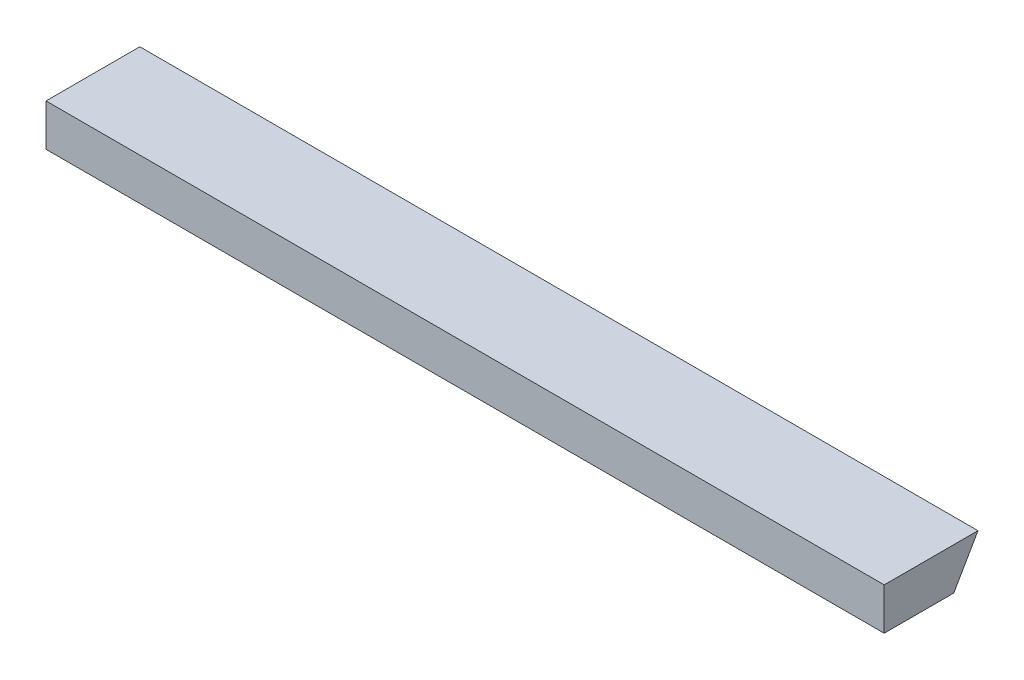
ISO-10303-21;
HEADER;
FILE_DESCRIPTION(('STEP AP214'),'2;1');
FILE_NAME('part.step','',(''),(''),'','','');
FILE_SCHEMA(('AUTOMOTIVE_DESIGN { 1 0 10303 214 1 1 1 1 }'));
ENDSEC;
DATA;
#1=APPLICATION_CONTEXT('core data for automotive mechanical design processes');
#2=APPLICATION_PROTOCOL_DEFINITION('international standard','automotive_design',2000,#1);
#3=PRODUCT_CONTEXT('',#1,'mechanical');
#4=PRODUCT('Part','Part','',(#3));
#5=PRODUCT_RELATED_PRODUCT_CATEGORY('part','',(#4));
#6=PRODUCT_DEFINITION_FORMATION('','',#4);
#7=PRODUCT_DEFINITION_CONTEXT('part definition',#1,'design');
#8=PRODUCT_DEFINITION('design','',#6,#7);
#9=PRODUCT_DEFINITION_SHAPE('','',#8);
#10=(LENGTH_UNIT() NAMED_UNIT(*) SI_UNIT(.MILLI.,.METRE.));
#11=(NAMED_UNIT(*) PLANE_ANGLE_UNIT() SI_UNIT($,.RADIAN.));
#12=(NAMED_UNIT(*) SI_UNIT($,.STERADIAN.) SOLID_ANGLE_UNIT());
#13=UNCERTAINTY_MEASURE_WITH_UNIT(LENGTH_MEASURE(1.E-05),#10,'distance_accuracy_value','');
#14=(GEOMETRIC_REPRESENTATION_CONTEXT(3) GLOBAL_UNCERTAINTY_ASSIGNED_CONTEXT((#13)) GLOBAL_UNIT_ASSIGNED_CONTEXT((#10,
#11,#12)) REPRESENTATION_CONTEXT('',''));
#15=CARTESIAN_POINT('',(0.,0.,0.));
#16=DIRECTION('',(0.,0.,1.));
#17=DIRECTION('',(1.,0.,0.));
#18=AXIS2_PLACEMENT_3D('',#15,#16,#17);
#19=CARTESIAN_POINT('',(309.664513958896,-55.6510067580703,5.2716639084455));
#20=DIRECTION('',(0.,0.500000000000003,0.866025403784437));
#21=DIRECTION('',(0.,-0.866025403784437,0.500000000000003));
#22=AXIS2_PLACEMENT_3D('',#19,#20,#21);
#23=PLANE('',#22);
#24=DIRECTION('',(-1.,0.,0.));
#25=VECTOR('',#24,1.);
#26=CARTESIAN_POINT('',(-240.,-12.,-19.9302565937248));
#27=LINE('',#26,#25);
#28=CARTESIAN_POINT('',(0.,-12.,-19.9302565937248));
#29=VERTEX_POINT('',#28);
#30=CARTESIAN_POINT('',(-240.,-12.,-19.9302565937248));
#31=VERTEX_POINT('',#30);
#32=EDGE_CURVE('E81',#29,#31,#27,.T.);
#33=ORIENTED_EDGE('',*,*,#32,.T.);
#34=DIRECTION('',(0.,0.866025403784437,-0.500000000000003));
#35=VECTOR('',#34,1.);
#36=CARTESIAN_POINT('',(-240.,-11.6300542570541,-20.1438448680002));
#37=LINE('',#36,#35);
#38=CARTESIAN_POINT('',(-240.,0.,-26.8584598240004));
#39=VERTEX_POINT('',#38);
#40=EDGE_CURVE('E84',#31,#39,#37,.T.);
#41=ORIENTED_EDGE('',*,*,#40,.T.);
#42=DIRECTION('',(1.,0.,0.));
#43=VECTOR('',#42,1.);
#44=CARTESIAN_POINT('',(-240.,0.,-26.8584598240004));
#45=LINE('',#44,#43);
#46=CARTESIAN_POINT('',(0.,0.,-26.8584598240004));
#47=VERTEX_POINT('',#46);
#48=EDGE_CURVE('E48',#39,#47,#45,.T.);
#49=ORIENTED_EDGE('',*,*,#48,.T.);
#50=DIRECTION('',(0.,0.866025403784437,-0.500000000000003));
#51=VECTOR('',#50,1.);
#52=CARTESIAN_POINT('',(0.,-11.6300542570541,-20.1438448680002));
#53=LINE('',#52,#51);
#54=EDGE_CURVE('E11',#29,#47,#53,.T.);
#55=ORIENTED_EDGE('',*,*,#54,.F.);
#56=EDGE_LOOP('',(#33,#41,#49,#55));
#57=FACE_BOUND('',#56,.T.);
#58=ADVANCED_FACE('F33',(#57),#23,.F.);
#59=CARTESIAN_POINT('',(-240.,-12.,0.));
#60=DIRECTION('',(0.,-1.,0.));
#61=DIRECTION('',(0.,0.,-1.));
#62=AXIS2_PLACEMENT_3D('',#59,#60,#61);
#63=PLANE('',#62);
#64=ORIENTED_EDGE('',*,*,#32,.F.);
#65=DIRECTION('',(0.,0.,-1.));
#66=VECTOR('',#65,1.);
#67=CARTESIAN_POINT('',(0.,-12.,0.));
#68=LINE('',#67,#66);
#69=CARTESIAN_POINT('',(0.,-12.,0.));
#70=VERTEX_POINT('',#69);
#71=EDGE_CURVE('E78',#70,#29,#68,.T.);
#72=ORIENTED_EDGE('',*,*,#71,.F.);
#73=DIRECTION('',(1.,0.,0.));
#74=VECTOR('',#73,1.);
#75=CARTESIAN_POINT('',(-240.,-12.,0.));
#76=LINE('',#75,#74);
#77=CARTESIAN_POINT('',(-240.,-12.,0.));
#78=VERTEX_POINT('',#77);
#79=EDGE_CURVE('E41',#78,#70,#76,.T.);
#80=ORIENTED_EDGE('',*,*,#79,.F.);
#81=DIRECTION('',(0.,0.,-1.));
#82=VECTOR('',#81,1.);
#83=CARTESIAN_POINT('',(-240.,-12.,0.));
#84=LINE('',#83,#82);
#85=EDGE_CURVE('E89',#78,#31,#84,.T.);
#86=ORIENTED_EDGE('',*,*,#85,.T.);
#87=EDGE_LOOP('',(#64,#72,#80,#86));
#88=FACE_BOUND('',#87,.T.);
#89=ADVANCED_FACE('F35',(#88),#63,.T.);
#90=CARTESIAN_POINT('',(-240.,0.,0.));
#91=DIRECTION('',(0.,0.,1.));
#92=DIRECTION('',(0.,-1.,0.));
#93=AXIS2_PLACEMENT_3D('',#90,#91,#92);
#94=PLANE('',#93);
#95=DIRECTION('',(0.,-1.,0.));
#96=VECTOR('',#95,1.);
#97=CARTESIAN_POINT('',(0.,0.,0.));
#98=LINE('',#97,#96);
#99=CARTESIAN_POINT('',(0.,0.,0.));
#100=VERTEX_POINT('',#99);
#101=EDGE_CURVE('E71',#100,#70,#98,.T.);
#102=ORIENTED_EDGE('',*,*,#101,.F.);
#103=DIRECTION('',(1.,0.,0.));
#104=VECTOR('',#103,1.);
#105=CARTESIAN_POINT('',(-240.,0.,0.));
#106=LINE('',#105,#104);
#107=CARTESIAN_POINT('',(-240.,0.,0.));
#108=VERTEX_POINT('',#107);
#109=EDGE_CURVE('E74',#108,#100,#106,.T.);
#110=ORIENTED_EDGE('',*,*,#109,.F.);
#111=DIRECTION('',(0.,-1.,0.));
#112=VECTOR('',#111,1.);
#113=CARTESIAN_POINT('',(-240.,0.,0.));
#114=LINE('',#113,#112);
#115=EDGE_CURVE('E73',#108,#78,#114,.T.);
#116=ORIENTED_EDGE('',*,*,#115,.T.);
#117=ORIENTED_EDGE('',*,*,#79,.T.);
#118=EDGE_LOOP('',(#102,#110,#116,#117));
#119=FACE_BOUND('',#118,.T.);
#120=ADVANCED_FACE('F68',(#119),#94,.T.);
#121=CARTESIAN_POINT('',(-240.,0.,0.));
#122=DIRECTION('',(0.,1.,0.));
#123=DIRECTION('',(0.,0.,1.));
#124=AXIS2_PLACEMENT_3D('',#121,#122,#123);
#125=PLANE('',#124);
#126=ORIENTED_EDGE('',*,*,#48,.F.);
#127=DIRECTION('',(0.,0.,1.));
#128=VECTOR('',#127,1.);
#129=CARTESIAN_POINT('',(-240.,0.,0.));
#130=LINE('',#129,#128);
#131=EDGE_CURVE('E91',#39,#108,#130,.T.);
#132=ORIENTED_EDGE('',*,*,#131,.T.);
#133=ORIENTED_EDGE('',*,*,#109,.T.);
#134=DIRECTION('',(0.,0.,1.));
#135=VECTOR('',#134,1.);
#136=CARTESIAN_POINT('',(0.,0.,0.));
#137=LINE('',#136,#135);
#138=EDGE_CURVE('E83',#47,#100,#137,.T.);
#139=ORIENTED_EDGE('',*,*,#138,.F.);
#140=EDGE_LOOP('',(#126,#132,#133,#139));
#141=FACE_BOUND('',#140,.T.);
#142=ADVANCED_FACE('F106',(#141),#125,.T.);
#143=CARTESIAN_POINT('',(-240.,0.,0.));
#144=DIRECTION('',(-1.,0.,0.));
#145=DIRECTION('',(0.,0.,1.));
#146=AXIS2_PLACEMENT_3D('',#143,#144,#145);
#147=PLANE('',#146);
#148=ORIENTED_EDGE('',*,*,#40,.F.);
#149=ORIENTED_EDGE('',*,*,#85,.F.);
#150=ORIENTED_EDGE('',*,*,#115,.F.);
#151=ORIENTED_EDGE('',*,*,#131,.F.);
#152=EDGE_LOOP('',(#148,#149,#150,#151));
#153=FACE_BOUND('',#152,.T.);
#154=ADVANCED_FACE('F104',(#153),#147,.T.);
#155=CARTESIAN_POINT('',(0.,0.,0.));
#156=DIRECTION('',(-1.,0.,0.));
#157=DIRECTION('',(0.,0.,1.));
#158=AXIS2_PLACEMENT_3D('',#155,#156,#157);
#159=PLANE('',#158);
#160=ORIENTED_EDGE('',*,*,#71,.T.);
#161=ORIENTED_EDGE('',*,*,#54,.T.);
#162=ORIENTED_EDGE('',*,*,#138,.T.);
#163=ORIENTED_EDGE('',*,*,#101,.T.);
#164=EDGE_LOOP('',(#160,#161,#162,#163));
#165=FACE_BOUND('',#164,.T.);
#166=ADVANCED_FACE('F86',(#165),#159,.F.);
#167=CLOSED_SHELL('',(#58,#89,#120,#142,#154,#166));
#168=MANIFOLD_SOLID_BREP('B2',#167);
#169=ADVANCED_BREP_SHAPE_REPRESENTATION('',(#18,#168),#14);
#170=SHAPE_DEFINITION_REPRESENTATION(#9,#169);
ENDSEC;
END-ISO-10303-21;
